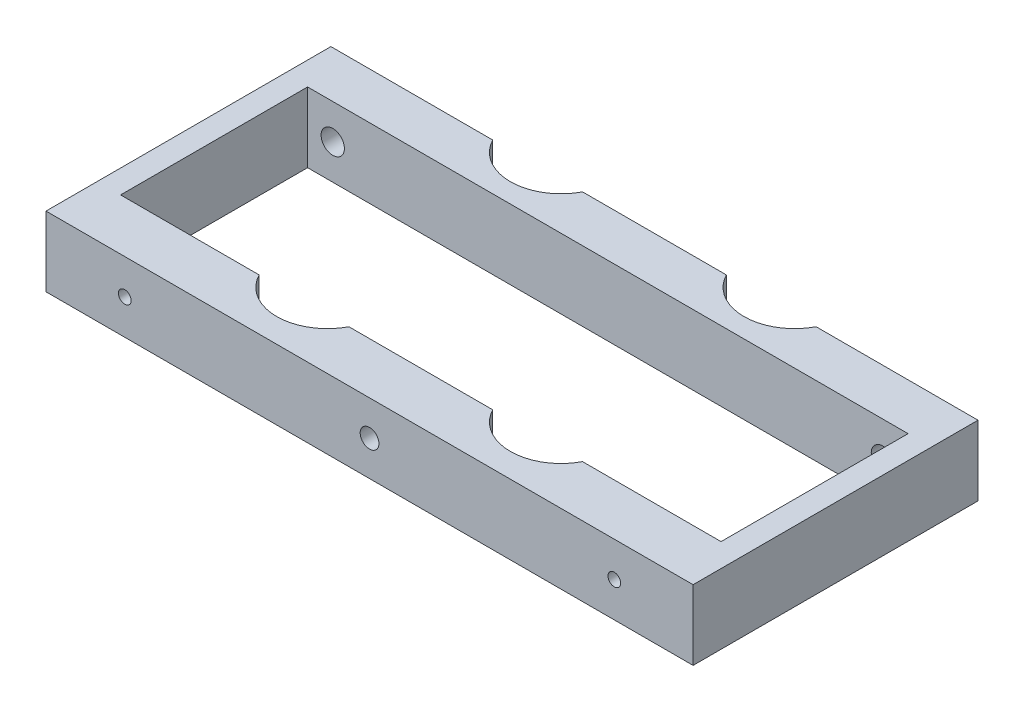
ISO-10303-21;
HEADER;
FILE_DESCRIPTION(('STEP AP214'),'2;1');
FILE_NAME('part.step','',(''),(''),'','','');
FILE_SCHEMA(('AUTOMOTIVE_DESIGN { 1 0 10303 214 1 1 1 1 }'));
ENDSEC;
DATA;
#1=APPLICATION_CONTEXT('core data for automotive mechanical design processes');
#2=APPLICATION_PROTOCOL_DEFINITION('international standard','automotive_design',2000,#1);
#3=PRODUCT_CONTEXT('',#1,'mechanical');
#4=PRODUCT('Part','Part','',(#3));
#5=PRODUCT_RELATED_PRODUCT_CATEGORY('part','',(#4));
#6=PRODUCT_DEFINITION_FORMATION('','',#4);
#7=PRODUCT_DEFINITION_CONTEXT('part definition',#1,'design');
#8=PRODUCT_DEFINITION('design','',#6,#7);
#9=PRODUCT_DEFINITION_SHAPE('','',#8);
#10=(LENGTH_UNIT() NAMED_UNIT(*) SI_UNIT(.MILLI.,.METRE.));
#11=(NAMED_UNIT(*) PLANE_ANGLE_UNIT() SI_UNIT($,.RADIAN.));
#12=(NAMED_UNIT(*) SI_UNIT($,.STERADIAN.) SOLID_ANGLE_UNIT());
#13=UNCERTAINTY_MEASURE_WITH_UNIT(LENGTH_MEASURE(1.E-05),#10,'distance_accuracy_value','');
#14=(GEOMETRIC_REPRESENTATION_CONTEXT(3) GLOBAL_UNCERTAINTY_ASSIGNED_CONTEXT((#13)) GLOBAL_UNIT_ASSIGNED_CONTEXT((#10,
#11,#12)) REPRESENTATION_CONTEXT('',''));
#15=CARTESIAN_POINT('',(0.,0.,0.));
#16=DIRECTION('',(0.,0.,1.));
#17=DIRECTION('',(1.,0.,0.));
#18=AXIS2_PLACEMENT_3D('',#15,#16,#17);
#19=CARTESIAN_POINT('',(119.95785,19.05,-83.9597));
#20=DIRECTION('',(0.,-1.,0.));
#21=DIRECTION('',(0.,0.,-1.));
#22=AXIS2_PLACEMENT_3D('',#19,#20,#21);
#23=CYLINDRICAL_SURFACE('',#22,13.7795);
#24=CARTESIAN_POINT('',(119.95785,0.,-83.9597));
#25=DIRECTION('',(0.,1.,0.));
#26=DIRECTION('',(0.,0.,1.));
#27=AXIS2_PLACEMENT_3D('',#24,#25,#26);
#28=CIRCLE('',#27,13.7795);
#29=CARTESIAN_POINT('',(107.728699569574,0.,-77.6097));
#30=VERTEX_POINT('',#29);
#31=CARTESIAN_POINT('',(132.187000430426,0.,-77.6097));
#32=VERTEX_POINT('',#31);
#33=EDGE_CURVE('E231',#30,#32,#28,.T.);
#34=ORIENTED_EDGE('',*,*,#33,.F.);
#35=DIRECTION('',(0.,-1.,0.));
#36=VECTOR('',#35,1.);
#37=CARTESIAN_POINT('',(107.728699569574,19.05,-77.6097));
#38=LINE('',#37,#36);
#39=CARTESIAN_POINT('',(107.728699569574,19.05,-77.6097));
#40=VERTEX_POINT('',#39);
#41=EDGE_CURVE('E11',#40,#30,#38,.T.);
#42=ORIENTED_EDGE('',*,*,#41,.F.);
#43=CARTESIAN_POINT('',(119.95785,19.05,-83.9597));
#44=DIRECTION('',(0.,1.,0.));
#45=DIRECTION('',(0.,0.,1.));
#46=AXIS2_PLACEMENT_3D('',#43,#44,#45);
#47=CIRCLE('',#46,13.7795);
#48=CARTESIAN_POINT('',(132.187000430426,19.05,-77.6097));
#49=VERTEX_POINT('',#48);
#50=EDGE_CURVE('E269',#40,#49,#47,.T.);
#51=ORIENTED_EDGE('',*,*,#50,.T.);
#52=DIRECTION('',(0.,-1.,0.));
#53=VECTOR('',#52,1.);
#54=CARTESIAN_POINT('',(132.187000430426,19.05,-77.6097));
#55=LINE('',#54,#53);
#56=EDGE_CURVE('E58',#49,#32,#55,.T.);
#57=ORIENTED_EDGE('',*,*,#56,.T.);
#58=EDGE_LOOP('',(#34,#42,#51,#57));
#59=FACE_BOUND('',#58,.T.);
#60=ADVANCED_FACE('F39',(#59),#23,.F.);
#61=CARTESIAN_POINT('',(0.,19.05,-77.6097));
#62=DIRECTION('',(0.,0.,-1.));
#63=DIRECTION('',(-1.,0.,0.));
#64=AXIS2_PLACEMENT_3D('',#61,#62,#63);
#65=PLANE('',#64);
#66=DIRECTION('',(1.,0.,0.));
#67=VECTOR('',#66,1.);
#68=CARTESIAN_POINT('',(0.,0.,-77.6097));
#69=LINE('',#68,#67);
#70=CARTESIAN_POINT('',(68.5473004304265,0.,-77.6097));
#71=VERTEX_POINT('',#70);
#72=EDGE_CURVE('E228',#71,#30,#69,.T.);
#73=ORIENTED_EDGE('',*,*,#72,.F.);
#74=DIRECTION('',(0.,-1.,0.));
#75=VECTOR('',#74,1.);
#76=CARTESIAN_POINT('',(68.5473004304265,19.05,-77.6097));
#77=LINE('',#76,#75);
#78=CARTESIAN_POINT('',(68.5473004304265,19.05,-77.6097));
#79=VERTEX_POINT('',#78);
#80=EDGE_CURVE('E49',#79,#71,#77,.T.);
#81=ORIENTED_EDGE('',*,*,#80,.F.);
#82=DIRECTION('',(1.,0.,0.));
#83=VECTOR('',#82,1.);
#84=CARTESIAN_POINT('',(0.,19.05,-77.6097));
#85=LINE('',#84,#83);
#86=EDGE_CURVE('E266',#79,#40,#85,.T.);
#87=ORIENTED_EDGE('',*,*,#86,.T.);
#88=ORIENTED_EDGE('',*,*,#41,.T.);
#89=EDGE_LOOP('',(#73,#81,#87,#88));
#90=FACE_BOUND('',#89,.T.);
#91=ADVANCED_FACE('F344',(#90),#65,.T.);
#92=CARTESIAN_POINT('',(56.31815,19.05,-83.9597));
#93=DIRECTION('',(0.,-1.,0.));
#94=DIRECTION('',(0.,0.,-1.));
#95=AXIS2_PLACEMENT_3D('',#92,#93,#94);
#96=CYLINDRICAL_SURFACE('',#95,13.7795);
#97=CARTESIAN_POINT('',(56.31815,0.,-83.9597));
#98=DIRECTION('',(0.,1.,0.));
#99=DIRECTION('',(0.,0.,1.));
#100=AXIS2_PLACEMENT_3D('',#97,#98,#99);
#101=CIRCLE('',#100,13.7795);
#102=CARTESIAN_POINT('',(44.0889995695735,0.,-77.6097));
#103=VERTEX_POINT('',#102);
#104=EDGE_CURVE('E225',#103,#71,#101,.T.);
#105=ORIENTED_EDGE('',*,*,#104,.F.);
#106=DIRECTION('',(0.,-1.,0.));
#107=VECTOR('',#106,1.);
#108=CARTESIAN_POINT('',(44.0889995695735,19.05,-77.6097));
#109=LINE('',#108,#107);
#110=CARTESIAN_POINT('',(44.0889995695735,19.05,-77.6097));
#111=VERTEX_POINT('',#110);
#112=EDGE_CURVE('E190',#111,#103,#109,.T.);
#113=ORIENTED_EDGE('',*,*,#112,.F.);
#114=CARTESIAN_POINT('',(56.31815,19.05,-83.9597));
#115=DIRECTION('',(0.,1.,0.));
#116=DIRECTION('',(0.,0.,1.));
#117=AXIS2_PLACEMENT_3D('',#114,#115,#116);
#118=CIRCLE('',#117,13.7795);
#119=EDGE_CURVE('E263',#111,#79,#118,.T.);
#120=ORIENTED_EDGE('',*,*,#119,.T.);
#121=ORIENTED_EDGE('',*,*,#80,.T.);
#122=EDGE_LOOP('',(#105,#113,#120,#121));
#123=FACE_BOUND('',#122,.T.);
#124=ADVANCED_FACE('F328',(#123),#96,.F.);
#125=CARTESIAN_POINT('',(0.,19.05,-77.6097));
#126=DIRECTION('',(0.,0.,-1.));
#127=DIRECTION('',(-1.,0.,0.));
#128=AXIS2_PLACEMENT_3D('',#125,#126,#127);
#129=PLANE('',#128);
#130=CARTESIAN_POINT('',(13.208,9.52500000000001,-77.6097));
#131=DIRECTION('',(0.,0.,-1.));
#132=DIRECTION('',(-1.,0.,0.));
#133=AXIS2_PLACEMENT_3D('',#130,#131,#132);
#134=CIRCLE('',#133,3.17499999999999);
#135=CARTESIAN_POINT('',(10.0330000000001,9.52500000000001,-77.6097));
#136=VERTEX_POINT('',#135);
#137=EDGE_CURVE('E317',#136,#136,#134,.T.);
#138=ORIENTED_EDGE('',*,*,#137,.F.);
#139=EDGE_LOOP('',(#138));
#140=FACE_BOUND('',#139,.T.);
#141=DIRECTION('',(1.,0.,0.));
#142=VECTOR('',#141,1.);
#143=CARTESIAN_POINT('',(0.,0.,-77.6097));
#144=LINE('',#143,#142);
#145=CARTESIAN_POINT('',(0.,0.,-77.6097));
#146=VERTEX_POINT('',#145);
#147=EDGE_CURVE('E222',#146,#103,#144,.T.);
#148=ORIENTED_EDGE('',*,*,#147,.F.);
#149=DIRECTION('',(0.,-1.,0.));
#150=VECTOR('',#149,1.);
#151=CARTESIAN_POINT('',(0.,19.05,-77.6097));
#152=LINE('',#151,#150);
#153=CARTESIAN_POINT('',(0.,19.05,-77.6097));
#154=VERTEX_POINT('',#153);
#155=EDGE_CURVE('E184',#154,#146,#152,.T.);
#156=ORIENTED_EDGE('',*,*,#155,.F.);
#157=DIRECTION('',(1.,0.,0.));
#158=VECTOR('',#157,1.);
#159=CARTESIAN_POINT('',(0.,19.05,-77.6097));
#160=LINE('',#159,#158);
#161=EDGE_CURVE('E260',#154,#111,#160,.T.);
#162=ORIENTED_EDGE('',*,*,#161,.T.);
#163=ORIENTED_EDGE('',*,*,#112,.T.);
#164=EDGE_LOOP('',(#148,#156,#162,#163));
#165=FACE_BOUND('',#164,.T.);
#166=ADVANCED_FACE('F324',(#140,#165),#129,.T.);
#167=CARTESIAN_POINT('',(0.,19.05,0.));
#168=DIRECTION('',(-1.,0.,0.));
#169=DIRECTION('',(0.,0.,1.));
#170=AXIS2_PLACEMENT_3D('',#167,#168,#169);
#171=PLANE('',#170);
#172=DIRECTION('',(0.,0.,-1.));
#173=VECTOR('',#172,1.);
#174=CARTESIAN_POINT('',(0.,0.,0.));
#175=LINE('',#174,#173);
#176=CARTESIAN_POINT('',(0.,0.,0.));
#177=VERTEX_POINT('',#176);
#178=EDGE_CURVE('E219',#177,#146,#175,.T.);
#179=ORIENTED_EDGE('',*,*,#178,.F.);
#180=DIRECTION('',(0.,-1.,0.));
#181=VECTOR('',#180,1.);
#182=CARTESIAN_POINT('',(0.,19.05,0.));
#183=LINE('',#182,#181);
#184=CARTESIAN_POINT('',(0.,19.05,0.));
#185=VERTEX_POINT('',#184);
#186=EDGE_CURVE('E182',#185,#177,#183,.T.);
#187=ORIENTED_EDGE('',*,*,#186,.F.);
#188=DIRECTION('',(0.,0.,-1.));
#189=VECTOR('',#188,1.);
#190=CARTESIAN_POINT('',(0.,19.05,0.));
#191=LINE('',#190,#189);
#192=EDGE_CURVE('E176',#185,#154,#191,.T.);
#193=ORIENTED_EDGE('',*,*,#192,.T.);
#194=ORIENTED_EDGE('',*,*,#155,.T.);
#195=EDGE_LOOP('',(#179,#187,#193,#194));
#196=FACE_BOUND('',#195,.T.);
#197=ADVANCED_FACE('F327',(#196),#171,.T.);
#198=CARTESIAN_POINT('',(0.,19.05,0.));
#199=DIRECTION('',(0.,0.,-1.));
#200=DIRECTION('',(-1.,0.,0.));
#201=AXIS2_PLACEMENT_3D('',#198,#199,#200);
#202=PLANE('',#201);
#203=CARTESIAN_POINT('',(88.138,9.525,0.));
#204=DIRECTION('',(0.,0.,1.));
#205=DIRECTION('',(1.,0.,0.));
#206=AXIS2_PLACEMENT_3D('',#203,#204,#205);
#207=CIRCLE('',#206,2.55269999999999);
#208=CARTESIAN_POINT('',(90.6907,9.525,0.));
#209=VERTEX_POINT('',#208);
#210=EDGE_CURVE('E305',#209,#209,#207,.T.);
#211=ORIENTED_EDGE('',*,*,#210,.F.);
#212=EDGE_LOOP('',(#211));
#213=FACE_BOUND('',#212,.T.);
#214=CARTESIAN_POINT('',(154.813,9.52500000000001,0.));
#215=DIRECTION('',(0.,0.,1.));
#216=DIRECTION('',(1.,0.,0.));
#217=AXIS2_PLACEMENT_3D('',#214,#215,#216);
#218=CIRCLE('',#217,1.72719999999998);
#219=CARTESIAN_POINT('',(156.5402,9.52500000000001,0.));
#220=VERTEX_POINT('',#219);
#221=EDGE_CURVE('E299',#220,#220,#218,.T.);
#222=ORIENTED_EDGE('',*,*,#221,.F.);
#223=EDGE_LOOP('',(#222));
#224=FACE_BOUND('',#223,.T.);
#225=CARTESIAN_POINT('',(21.463,9.525,0.));
#226=DIRECTION('',(0.,0.,1.));
#227=DIRECTION('',(1.,0.,0.));
#228=AXIS2_PLACEMENT_3D('',#225,#226,#227);
#229=CIRCLE('',#228,1.7272);
#230=CARTESIAN_POINT('',(23.1902,9.525,0.));
#231=VERTEX_POINT('',#230);
#232=EDGE_CURVE('E293',#231,#231,#229,.T.);
#233=ORIENTED_EDGE('',*,*,#232,.F.);
#234=EDGE_LOOP('',(#233));
#235=FACE_BOUND('',#234,.T.);
#236=DIRECTION('',(1.,0.,0.));
#237=VECTOR('',#236,1.);
#238=CARTESIAN_POINT('',(0.,0.,0.));
#239=LINE('',#238,#237);
#240=CARTESIAN_POINT('',(176.276,0.,0.));
#241=VERTEX_POINT('',#240);
#242=EDGE_CURVE('E181',#177,#241,#239,.T.);
#243=ORIENTED_EDGE('',*,*,#242,.T.);
#244=DIRECTION('',(0.,-1.,0.));
#245=VECTOR('',#244,1.);
#246=CARTESIAN_POINT('',(176.276,19.05,0.));
#247=LINE('',#246,#245);
#248=CARTESIAN_POINT('',(176.276,19.05,0.));
#249=VERTEX_POINT('',#248);
#250=EDGE_CURVE('E163',#249,#241,#247,.T.);
#251=ORIENTED_EDGE('',*,*,#250,.F.);
#252=DIRECTION('',(1.,0.,0.));
#253=VECTOR('',#252,1.);
#254=CARTESIAN_POINT('',(0.,19.05,0.));
#255=LINE('',#254,#253);
#256=EDGE_CURVE('E168',#185,#249,#255,.T.);
#257=ORIENTED_EDGE('',*,*,#256,.F.);
#258=ORIENTED_EDGE('',*,*,#186,.T.);
#259=EDGE_LOOP('',(#243,#251,#257,#258));
#260=FACE_BOUND('',#259,.T.);
#261=ADVANCED_FACE('F179',(#213,#224,#235,#260),#202,.F.);
#262=CARTESIAN_POINT('',(176.276,19.05,0.));
#263=DIRECTION('',(-1.,0.,0.));
#264=DIRECTION('',(0.,0.,1.));
#265=AXIS2_PLACEMENT_3D('',#262,#263,#264);
#266=PLANE('',#265);
#267=DIRECTION('',(0.,0.,-1.));
#268=VECTOR('',#267,1.);
#269=CARTESIAN_POINT('',(176.276,0.,0.));
#270=LINE('',#269,#268);
#271=CARTESIAN_POINT('',(176.276,0.,-77.6097));
#272=VERTEX_POINT('',#271);
#273=EDGE_CURVE('E216',#241,#272,#270,.T.);
#274=ORIENTED_EDGE('',*,*,#273,.T.);
#275=DIRECTION('',(0.,-1.,0.));
#276=VECTOR('',#275,1.);
#277=CARTESIAN_POINT('',(176.276,19.05,-77.6097));
#278=LINE('',#277,#276);
#279=CARTESIAN_POINT('',(176.276,19.05,-77.6097));
#280=VERTEX_POINT('',#279);
#281=EDGE_CURVE('E108',#280,#272,#278,.T.);
#282=ORIENTED_EDGE('',*,*,#281,.F.);
#283=DIRECTION('',(0.,0.,-1.));
#284=VECTOR('',#283,1.);
#285=CARTESIAN_POINT('',(176.276,19.05,0.));
#286=LINE('',#285,#284);
#287=EDGE_CURVE('E159',#249,#280,#286,.T.);
#288=ORIENTED_EDGE('',*,*,#287,.F.);
#289=ORIENTED_EDGE('',*,*,#250,.T.);
#290=EDGE_LOOP('',(#274,#282,#288,#289));
#291=FACE_BOUND('',#290,.T.);
#292=ADVANCED_FACE('F161',(#291),#266,.F.);
#293=CARTESIAN_POINT('',(119.95785,19.05,-20.32));
#294=DIRECTION('',(0.,-1.,0.));
#295=DIRECTION('',(0.,0.,-1.));
#296=AXIS2_PLACEMENT_3D('',#293,#294,#295);
#297=CYLINDRICAL_SURFACE('',#296,13.7795);
#298=CARTESIAN_POINT('',(119.95785,0.,-20.32));
#299=DIRECTION('',(0.,1.,0.));
#300=DIRECTION('',(0.,0.,1.));
#301=AXIS2_PLACEMENT_3D('',#298,#299,#300);
#302=CIRCLE('',#301,13.7795);
#303=CARTESIAN_POINT('',(107.728699569574,0.,-13.97));
#304=VERTEX_POINT('',#303);
#305=CARTESIAN_POINT('',(132.187000430426,0.,-13.97));
#306=VERTEX_POINT('',#305);
#307=EDGE_CURVE('E254',#304,#306,#302,.T.);
#308=ORIENTED_EDGE('',*,*,#307,.F.);
#309=DIRECTION('',(0.,-1.,0.));
#310=VECTOR('',#309,1.);
#311=CARTESIAN_POINT('',(107.728699569574,19.05,-13.97));
#312=LINE('',#311,#310);
#313=CARTESIAN_POINT('',(107.728699569574,19.05,-13.97));
#314=VERTEX_POINT('',#313);
#315=EDGE_CURVE('E43',#314,#304,#312,.T.);
#316=ORIENTED_EDGE('',*,*,#315,.F.);
#317=CARTESIAN_POINT('',(119.95785,19.05,-20.32));
#318=DIRECTION('',(0.,1.,0.));
#319=DIRECTION('',(0.,0.,1.));
#320=AXIS2_PLACEMENT_3D('',#317,#318,#319);
#321=CIRCLE('',#320,13.7795);
#322=CARTESIAN_POINT('',(132.187000430426,19.05,-13.97));
#323=VERTEX_POINT('',#322);
#324=EDGE_CURVE('E215',#314,#323,#321,.T.);
#325=ORIENTED_EDGE('',*,*,#324,.T.);
#326=DIRECTION('',(0.,-1.,0.));
#327=VECTOR('',#326,1.);
#328=CARTESIAN_POINT('',(132.187000430426,19.05,-13.97));
#329=LINE('',#328,#327);
#330=EDGE_CURVE('E193',#323,#306,#329,.T.);
#331=ORIENTED_EDGE('',*,*,#330,.T.);
#332=EDGE_LOOP('',(#308,#316,#325,#331));
#333=FACE_BOUND('',#332,.T.);
#334=ADVANCED_FACE('F41',(#333),#297,.F.);
#335=CARTESIAN_POINT('',(0.,19.05,-13.97));
#336=DIRECTION('',(0.,0.,-1.));
#337=DIRECTION('',(-1.,0.,0.));
#338=AXIS2_PLACEMENT_3D('',#335,#336,#337);
#339=PLANE('',#338);
#340=CARTESIAN_POINT('',(88.138,9.525,-13.97));
#341=DIRECTION('',(0.,0.,-1.));
#342=DIRECTION('',(-1.,0.,0.));
#343=AXIS2_PLACEMENT_3D('',#340,#341,#342);
#344=CIRCLE('',#343,2.55269999999999);
#345=CARTESIAN_POINT('',(85.5853,9.525,-13.97));
#346=VERTEX_POINT('',#345);
#347=EDGE_CURVE('E302',#346,#346,#344,.T.);
#348=ORIENTED_EDGE('',*,*,#347,.F.);
#349=EDGE_LOOP('',(#348));
#350=FACE_BOUND('',#349,.T.);
#351=DIRECTION('',(1.,0.,0.));
#352=VECTOR('',#351,1.);
#353=CARTESIAN_POINT('',(0.,0.,-13.97));
#354=LINE('',#353,#352);
#355=CARTESIAN_POINT('',(68.5473004304265,0.,-13.97));
#356=VERTEX_POINT('',#355);
#357=EDGE_CURVE('E251',#356,#304,#354,.T.);
#358=ORIENTED_EDGE('',*,*,#357,.F.);
#359=DIRECTION('',(0.,-1.,0.));
#360=VECTOR('',#359,1.);
#361=CARTESIAN_POINT('',(68.5473004304265,19.05,-13.97));
#362=LINE('',#361,#360);
#363=CARTESIAN_POINT('',(68.5473004304265,19.05,-13.97));
#364=VERTEX_POINT('',#363);
#365=EDGE_CURVE('E204',#364,#356,#362,.T.);
#366=ORIENTED_EDGE('',*,*,#365,.F.);
#367=DIRECTION('',(1.,0.,0.));
#368=VECTOR('',#367,1.);
#369=CARTESIAN_POINT('',(0.,19.05,-13.97));
#370=LINE('',#369,#368);
#371=EDGE_CURVE('E288',#364,#314,#370,.T.);
#372=ORIENTED_EDGE('',*,*,#371,.T.);
#373=ORIENTED_EDGE('',*,*,#315,.T.);
#374=EDGE_LOOP('',(#358,#366,#372,#373));
#375=FACE_BOUND('',#374,.T.);
#376=ADVANCED_FACE('F376',(#350,#375),#339,.T.);
#377=CARTESIAN_POINT('',(56.31815,19.05,-20.32));
#378=DIRECTION('',(0.,-1.,0.));
#379=DIRECTION('',(0.,0.,-1.));
#380=AXIS2_PLACEMENT_3D('',#377,#378,#379);
#381=CYLINDRICAL_SURFACE('',#380,13.7795);
#382=CARTESIAN_POINT('',(56.31815,0.,-20.32));
#383=DIRECTION('',(0.,1.,0.));
#384=DIRECTION('',(0.,0.,1.));
#385=AXIS2_PLACEMENT_3D('',#382,#383,#384);
#386=CIRCLE('',#385,13.7795);
#387=CARTESIAN_POINT('',(44.0889995695735,0.,-13.97));
#388=VERTEX_POINT('',#387);
#389=EDGE_CURVE('E248',#388,#356,#386,.T.);
#390=ORIENTED_EDGE('',*,*,#389,.F.);
#391=DIRECTION('',(0.,-1.,0.));
#392=VECTOR('',#391,1.);
#393=CARTESIAN_POINT('',(44.0889995695735,19.05,-13.97));
#394=LINE('',#393,#392);
#395=CARTESIAN_POINT('',(44.0889995695735,19.05,-13.97));
#396=VERTEX_POINT('',#395);
#397=EDGE_CURVE('E203',#396,#388,#394,.T.);
#398=ORIENTED_EDGE('',*,*,#397,.F.);
#399=CARTESIAN_POINT('',(56.31815,19.05,-20.32));
#400=DIRECTION('',(0.,1.,0.));
#401=DIRECTION('',(0.,0.,1.));
#402=AXIS2_PLACEMENT_3D('',#399,#400,#401);
#403=CIRCLE('',#402,13.7795);
#404=EDGE_CURVE('E286',#396,#364,#403,.T.);
#405=ORIENTED_EDGE('',*,*,#404,.T.);
#406=ORIENTED_EDGE('',*,*,#365,.T.);
#407=EDGE_LOOP('',(#390,#398,#405,#406));
#408=FACE_BOUND('',#407,.T.);
#409=ADVANCED_FACE('F373',(#408),#381,.F.);
#410=CARTESIAN_POINT('',(0.,19.05,-13.97));
#411=DIRECTION('',(0.,0.,-1.));
#412=DIRECTION('',(-1.,0.,0.));
#413=AXIS2_PLACEMENT_3D('',#410,#411,#412);
#414=PLANE('',#413);
#415=CARTESIAN_POINT('',(21.463,9.525,-13.97));
#416=DIRECTION('',(0.,0.,-1.));
#417=DIRECTION('',(-1.,0.,0.));
#418=AXIS2_PLACEMENT_3D('',#415,#416,#417);
#419=CIRCLE('',#418,1.7272);
#420=CARTESIAN_POINT('',(19.7358,9.525,-13.97));
#421=VERTEX_POINT('',#420);
#422=EDGE_CURVE('E257',#421,#421,#419,.T.);
#423=ORIENTED_EDGE('',*,*,#422,.F.);
#424=EDGE_LOOP('',(#423));
#425=FACE_BOUND('',#424,.T.);
#426=DIRECTION('',(1.,0.,0.));
#427=VECTOR('',#426,1.);
#428=CARTESIAN_POINT('',(0.,0.,-13.97));
#429=LINE('',#428,#427);
#430=CARTESIAN_POINT('',(6.35000000000001,0.,-13.97));
#431=VERTEX_POINT('',#430);
#432=EDGE_CURVE('E245',#431,#388,#429,.T.);
#433=ORIENTED_EDGE('',*,*,#432,.F.);
#434=DIRECTION('',(0.,-1.,0.));
#435=VECTOR('',#434,1.);
#436=CARTESIAN_POINT('',(6.35000000000001,19.05,-13.97));
#437=LINE('',#436,#435);
#438=CARTESIAN_POINT('',(6.35000000000001,19.05,-13.97));
#439=VERTEX_POINT('',#438);
#440=EDGE_CURVE('E201',#439,#431,#437,.T.);
#441=ORIENTED_EDGE('',*,*,#440,.F.);
#442=DIRECTION('',(1.,0.,0.));
#443=VECTOR('',#442,1.);
#444=CARTESIAN_POINT('',(0.,19.05,-13.97));
#445=LINE('',#444,#443);
#446=EDGE_CURVE('E283',#439,#396,#445,.T.);
#447=ORIENTED_EDGE('',*,*,#446,.T.);
#448=ORIENTED_EDGE('',*,*,#397,.T.);
#449=EDGE_LOOP('',(#433,#441,#447,#448));
#450=FACE_BOUND('',#449,.T.);
#451=ADVANCED_FACE('F369',(#425,#450),#414,.T.);
#452=CARTESIAN_POINT('',(6.35000000000001,19.05,0.));
#453=DIRECTION('',(1.,0.,0.));
#454=DIRECTION('',(0.,0.,-1.));
#455=AXIS2_PLACEMENT_3D('',#452,#453,#454);
#456=PLANE('',#455);
#457=DIRECTION('',(0.,0.,1.));
#458=VECTOR('',#457,1.);
#459=CARTESIAN_POINT('',(6.35000000000001,0.,0.));
#460=LINE('',#459,#458);
#461=CARTESIAN_POINT('',(6.34999999999999,0.,-64.9097));
#462=VERTEX_POINT('',#461);
#463=EDGE_CURVE('E242',#462,#431,#460,.T.);
#464=ORIENTED_EDGE('',*,*,#463,.F.);
#465=DIRECTION('',(0.,-1.,0.));
#466=VECTOR('',#465,1.);
#467=CARTESIAN_POINT('',(6.34999999999999,19.05,-64.9097));
#468=LINE('',#467,#466);
#469=CARTESIAN_POINT('',(6.34999999999999,19.05,-64.9097));
#470=VERTEX_POINT('',#469);
#471=EDGE_CURVE('E199',#470,#462,#468,.T.);
#472=ORIENTED_EDGE('',*,*,#471,.F.);
#473=DIRECTION('',(0.,0.,1.));
#474=VECTOR('',#473,1.);
#475=CARTESIAN_POINT('',(6.35000000000001,19.05,0.));
#476=LINE('',#475,#474);
#477=EDGE_CURVE('E280',#470,#439,#476,.T.);
#478=ORIENTED_EDGE('',*,*,#477,.T.);
#479=ORIENTED_EDGE('',*,*,#440,.T.);
#480=EDGE_LOOP('',(#464,#472,#478,#479));
#481=FACE_BOUND('',#480,.T.);
#482=ADVANCED_FACE('F365',(#481),#456,.T.);
#483=CARTESIAN_POINT('',(0.,19.05,-64.9097));
#484=DIRECTION('',(0.,0.,1.));
#485=DIRECTION('',(1.,0.,0.));
#486=AXIS2_PLACEMENT_3D('',#483,#484,#485);
#487=PLANE('',#486);
#488=CARTESIAN_POINT('',(13.208,9.52500000000001,-64.9097));
#489=DIRECTION('',(0.,0.,1.));
#490=DIRECTION('',(1.,0.,0.));
#491=AXIS2_PLACEMENT_3D('',#488,#489,#490);
#492=CIRCLE('',#491,3.17499999999999);
#493=CARTESIAN_POINT('',(16.383,9.52500000000001,-64.9097));
#494=VERTEX_POINT('',#493);
#495=EDGE_CURVE('E314',#494,#494,#492,.T.);
#496=ORIENTED_EDGE('',*,*,#495,.F.);
#497=EDGE_LOOP('',(#496));
#498=FACE_BOUND('',#497,.T.);
#499=CARTESIAN_POINT('',(163.068,9.525,-64.9097));
#500=DIRECTION('',(0.,0.,1.));
#501=DIRECTION('',(1.,0.,0.));
#502=AXIS2_PLACEMENT_3D('',#499,#500,#501);
#503=CIRCLE('',#502,3.17499999999998);
#504=CARTESIAN_POINT('',(166.243,9.525,-64.9097));
#505=VERTEX_POINT('',#504);
#506=EDGE_CURVE('E308',#505,#505,#503,.T.);
#507=ORIENTED_EDGE('',*,*,#506,.F.);
#508=EDGE_LOOP('',(#507));
#509=FACE_BOUND('',#508,.T.);
#510=DIRECTION('',(-1.,0.,0.));
#511=VECTOR('',#510,1.);
#512=CARTESIAN_POINT('',(0.,0.,-64.9097));
#513=LINE('',#512,#511);
#514=CARTESIAN_POINT('',(169.926,0.,-64.9097));
#515=VERTEX_POINT('',#514);
#516=EDGE_CURVE('E239',#515,#462,#513,.T.);
#517=ORIENTED_EDGE('',*,*,#516,.F.);
#518=DIRECTION('',(0.,-1.,0.));
#519=VECTOR('',#518,1.);
#520=CARTESIAN_POINT('',(169.926,19.05,-64.9097));
#521=LINE('',#520,#519);
#522=CARTESIAN_POINT('',(169.926,19.05,-64.9097));
#523=VERTEX_POINT('',#522);
#524=EDGE_CURVE('E197',#523,#515,#521,.T.);
#525=ORIENTED_EDGE('',*,*,#524,.F.);
#526=DIRECTION('',(-1.,0.,0.));
#527=VECTOR('',#526,1.);
#528=CARTESIAN_POINT('',(0.,19.05,-64.9097));
#529=LINE('',#528,#527);
#530=EDGE_CURVE('E277',#523,#470,#529,.T.);
#531=ORIENTED_EDGE('',*,*,#530,.T.);
#532=ORIENTED_EDGE('',*,*,#471,.T.);
#533=EDGE_LOOP('',(#517,#525,#531,#532));
#534=FACE_BOUND('',#533,.T.);
#535=ADVANCED_FACE('F361',(#498,#509,#534),#487,.T.);
#536=CARTESIAN_POINT('',(169.926,19.05,0.));
#537=DIRECTION('',(-1.,0.,0.));
#538=DIRECTION('',(0.,0.,1.));
#539=AXIS2_PLACEMENT_3D('',#536,#537,#538);
#540=PLANE('',#539);
#541=DIRECTION('',(0.,0.,-1.));
#542=VECTOR('',#541,1.);
#543=CARTESIAN_POINT('',(169.926,0.,0.));
#544=LINE('',#543,#542);
#545=CARTESIAN_POINT('',(169.926,0.,-13.97));
#546=VERTEX_POINT('',#545);
#547=EDGE_CURVE('E236',#546,#515,#544,.T.);
#548=ORIENTED_EDGE('',*,*,#547,.F.);
#549=DIRECTION('',(0.,-1.,0.));
#550=VECTOR('',#549,1.);
#551=CARTESIAN_POINT('',(169.926,19.05,-13.97));
#552=LINE('',#551,#550);
#553=CARTESIAN_POINT('',(169.926,19.05,-13.97));
#554=VERTEX_POINT('',#553);
#555=EDGE_CURVE('E195',#554,#546,#552,.T.);
#556=ORIENTED_EDGE('',*,*,#555,.F.);
#557=DIRECTION('',(0.,0.,-1.));
#558=VECTOR('',#557,1.);
#559=CARTESIAN_POINT('',(169.926,19.05,0.));
#560=LINE('',#559,#558);
#561=EDGE_CURVE('E274',#554,#523,#560,.T.);
#562=ORIENTED_EDGE('',*,*,#561,.T.);
#563=ORIENTED_EDGE('',*,*,#524,.T.);
#564=EDGE_LOOP('',(#548,#556,#562,#563));
#565=FACE_BOUND('',#564,.T.);
#566=ADVANCED_FACE('F357',(#565),#540,.T.);
#567=CARTESIAN_POINT('',(0.,19.05,-13.97));
#568=DIRECTION('',(0.,0.,-1.));
#569=DIRECTION('',(-1.,0.,0.));
#570=AXIS2_PLACEMENT_3D('',#567,#568,#569);
#571=PLANE('',#570);
#572=CARTESIAN_POINT('',(154.813,9.52500000000001,-13.97));
#573=DIRECTION('',(0.,0.,-1.));
#574=DIRECTION('',(-1.,0.,0.));
#575=AXIS2_PLACEMENT_3D('',#572,#573,#574);
#576=CIRCLE('',#575,1.72719999999998);
#577=CARTESIAN_POINT('',(153.0858,9.52500000000001,-13.97));
#578=VERTEX_POINT('',#577);
#579=EDGE_CURVE('E296',#578,#578,#576,.T.);
#580=ORIENTED_EDGE('',*,*,#579,.F.);
#581=EDGE_LOOP('',(#580));
#582=FACE_BOUND('',#581,.T.);
#583=DIRECTION('',(1.,0.,0.));
#584=VECTOR('',#583,1.);
#585=CARTESIAN_POINT('',(0.,0.,-13.97));
#586=LINE('',#585,#584);
#587=EDGE_CURVE('E233',#306,#546,#586,.T.);
#588=ORIENTED_EDGE('',*,*,#587,.F.);
#589=ORIENTED_EDGE('',*,*,#330,.F.);
#590=DIRECTION('',(1.,0.,0.));
#591=VECTOR('',#590,1.);
#592=CARTESIAN_POINT('',(0.,19.05,-13.97));
#593=LINE('',#592,#591);
#594=EDGE_CURVE('E271',#323,#554,#593,.T.);
#595=ORIENTED_EDGE('',*,*,#594,.T.);
#596=ORIENTED_EDGE('',*,*,#555,.T.);
#597=EDGE_LOOP('',(#588,#589,#595,#596));
#598=FACE_BOUND('',#597,.T.);
#599=ADVANCED_FACE('F353',(#582,#598),#571,.T.);
#600=CARTESIAN_POINT('',(0.,19.05,-77.6097));
#601=DIRECTION('',(0.,0.,-1.));
#602=DIRECTION('',(-1.,0.,0.));
#603=AXIS2_PLACEMENT_3D('',#600,#601,#602);
#604=PLANE('',#603);
#605=CARTESIAN_POINT('',(163.068,9.525,-77.6097));
#606=DIRECTION('',(0.,0.,-1.));
#607=DIRECTION('',(-1.,0.,0.));
#608=AXIS2_PLACEMENT_3D('',#605,#606,#607);
#609=CIRCLE('',#608,3.17499999999998);
#610=CARTESIAN_POINT('',(159.893,9.525,-77.6097));
#611=VERTEX_POINT('',#610);
#612=EDGE_CURVE('E311',#611,#611,#609,.T.);
#613=ORIENTED_EDGE('',*,*,#612,.F.);
#614=EDGE_LOOP('',(#613));
#615=FACE_BOUND('',#614,.T.);
#616=DIRECTION('',(1.,0.,0.));
#617=VECTOR('',#616,1.);
#618=CARTESIAN_POINT('',(0.,0.,-77.6097));
#619=LINE('',#618,#617);
#620=EDGE_CURVE('E212',#32,#272,#619,.T.);
#621=ORIENTED_EDGE('',*,*,#620,.F.);
#622=ORIENTED_EDGE('',*,*,#56,.F.);
#623=DIRECTION('',(1.,0.,0.));
#624=VECTOR('',#623,1.);
#625=CARTESIAN_POINT('',(0.,19.05,-77.6097));
#626=LINE('',#625,#624);
#627=EDGE_CURVE('E167',#49,#280,#626,.T.);
#628=ORIENTED_EDGE('',*,*,#627,.T.);
#629=ORIENTED_EDGE('',*,*,#281,.T.);
#630=EDGE_LOOP('',(#621,#622,#628,#629));
#631=FACE_BOUND('',#630,.T.);
#632=ADVANCED_FACE('F356',(#615,#631),#604,.T.);
#633=CARTESIAN_POINT('',(0.,19.05,0.));
#634=DIRECTION('',(0.,1.,0.));
#635=DIRECTION('',(0.,0.,1.));
#636=AXIS2_PLACEMENT_3D('',#633,#634,#635);
#637=PLANE('',#636);
#638=ORIENTED_EDGE('',*,*,#324,.F.);
#639=ORIENTED_EDGE('',*,*,#371,.F.);
#640=ORIENTED_EDGE('',*,*,#404,.F.);
#641=ORIENTED_EDGE('',*,*,#446,.F.);
#642=ORIENTED_EDGE('',*,*,#477,.F.);
#643=ORIENTED_EDGE('',*,*,#530,.F.);
#644=ORIENTED_EDGE('',*,*,#561,.F.);
#645=ORIENTED_EDGE('',*,*,#594,.F.);
#646=EDGE_LOOP('',(#638,#639,#640,#641,#642,#643,#644,#645));
#647=FACE_BOUND('',#646,.T.);
#648=ORIENTED_EDGE('',*,*,#50,.F.);
#649=ORIENTED_EDGE('',*,*,#86,.F.);
#650=ORIENTED_EDGE('',*,*,#119,.F.);
#651=ORIENTED_EDGE('',*,*,#161,.F.);
#652=ORIENTED_EDGE('',*,*,#192,.F.);
#653=ORIENTED_EDGE('',*,*,#256,.T.);
#654=ORIENTED_EDGE('',*,*,#287,.T.);
#655=ORIENTED_EDGE('',*,*,#627,.F.);
#656=EDGE_LOOP('',(#648,#649,#650,#651,#652,#653,#654,#655));
#657=FACE_BOUND('',#656,.T.);
#658=ADVANCED_FACE('F173',(#647,#657),#637,.T.);
#659=CARTESIAN_POINT('',(0.,0.,0.));
#660=DIRECTION('',(0.,1.,0.));
#661=DIRECTION('',(0.,0.,1.));
#662=AXIS2_PLACEMENT_3D('',#659,#660,#661);
#663=PLANE('',#662);
#664=ORIENTED_EDGE('',*,*,#307,.T.);
#665=ORIENTED_EDGE('',*,*,#587,.T.);
#666=ORIENTED_EDGE('',*,*,#547,.T.);
#667=ORIENTED_EDGE('',*,*,#516,.T.);
#668=ORIENTED_EDGE('',*,*,#463,.T.);
#669=ORIENTED_EDGE('',*,*,#432,.T.);
#670=ORIENTED_EDGE('',*,*,#389,.T.);
#671=ORIENTED_EDGE('',*,*,#357,.T.);
#672=EDGE_LOOP('',(#664,#665,#666,#667,#668,#669,#670,#671));
#673=FACE_BOUND('',#672,.T.);
#674=ORIENTED_EDGE('',*,*,#33,.T.);
#675=ORIENTED_EDGE('',*,*,#620,.T.);
#676=ORIENTED_EDGE('',*,*,#273,.F.);
#677=ORIENTED_EDGE('',*,*,#242,.F.);
#678=ORIENTED_EDGE('',*,*,#178,.T.);
#679=ORIENTED_EDGE('',*,*,#147,.T.);
#680=ORIENTED_EDGE('',*,*,#104,.T.);
#681=ORIENTED_EDGE('',*,*,#72,.T.);
#682=EDGE_LOOP('',(#674,#675,#676,#677,#678,#679,#680,#681));
#683=FACE_BOUND('',#682,.T.);
#684=ADVANCED_FACE('F334',(#673,#683),#663,.F.);
#685=CARTESIAN_POINT('',(21.463,9.525,0.));
#686=DIRECTION('',(0.,0.,1.));
#687=DIRECTION('',(1.,0.,0.));
#688=AXIS2_PLACEMENT_3D('',#685,#686,#687);
#689=CYLINDRICAL_SURFACE('',#688,1.7272);
#690=ORIENTED_EDGE('',*,*,#232,.T.);
#691=EDGE_LOOP('',(#690));
#692=FACE_BOUND('',#691,.T.);
#693=ORIENTED_EDGE('',*,*,#422,.T.);
#694=EDGE_LOOP('',(#693));
#695=FACE_BOUND('',#694,.T.);
#696=ADVANCED_FACE('F406',(#692,#695),#689,.F.);
#697=CARTESIAN_POINT('',(154.813,9.52500000000001,0.));
#698=DIRECTION('',(0.,0.,1.));
#699=DIRECTION('',(1.,0.,0.));
#700=AXIS2_PLACEMENT_3D('',#697,#698,#699);
#701=CYLINDRICAL_SURFACE('',#700,1.72719999999998);
#702=ORIENTED_EDGE('',*,*,#221,.T.);
#703=EDGE_LOOP('',(#702));
#704=FACE_BOUND('',#703,.T.);
#705=ORIENTED_EDGE('',*,*,#579,.T.);
#706=EDGE_LOOP('',(#705));
#707=FACE_BOUND('',#706,.T.);
#708=ADVANCED_FACE('F475',(#704,#707),#701,.F.);
#709=CARTESIAN_POINT('',(88.138,9.525,0.));
#710=DIRECTION('',(0.,0.,1.));
#711=DIRECTION('',(1.,0.,0.));
#712=AXIS2_PLACEMENT_3D('',#709,#710,#711);
#713=CYLINDRICAL_SURFACE('',#712,2.55269999999999);
#714=ORIENTED_EDGE('',*,*,#210,.T.);
#715=EDGE_LOOP('',(#714));
#716=FACE_BOUND('',#715,.T.);
#717=ORIENTED_EDGE('',*,*,#347,.T.);
#718=EDGE_LOOP('',(#717));
#719=FACE_BOUND('',#718,.T.);
#720=ADVANCED_FACE('F484',(#716,#719),#713,.F.);
#721=CARTESIAN_POINT('',(163.068,9.525,-77.6097));
#722=DIRECTION('',(0.,0.,-1.));
#723=DIRECTION('',(-1.,0.,0.));
#724=AXIS2_PLACEMENT_3D('',#721,#722,#723);
#725=CYLINDRICAL_SURFACE('',#724,3.17499999999998);
#726=ORIENTED_EDGE('',*,*,#612,.T.);
#727=EDGE_LOOP('',(#726));
#728=FACE_BOUND('',#727,.T.);
#729=ORIENTED_EDGE('',*,*,#506,.T.);
#730=EDGE_LOOP('',(#729));
#731=FACE_BOUND('',#730,.T.);
#732=ADVANCED_FACE('F502',(#728,#731),#725,.F.);
#733=CARTESIAN_POINT('',(13.208,9.52500000000001,-77.6097));
#734=DIRECTION('',(0.,0.,-1.));
#735=DIRECTION('',(-1.,0.,0.));
#736=AXIS2_PLACEMENT_3D('',#733,#734,#735);
#737=CYLINDRICAL_SURFACE('',#736,3.17499999999999);
#738=ORIENTED_EDGE('',*,*,#137,.T.);
#739=EDGE_LOOP('',(#738));
#740=FACE_BOUND('',#739,.T.);
#741=ORIENTED_EDGE('',*,*,#495,.T.);
#742=EDGE_LOOP('',(#741));
#743=FACE_BOUND('',#742,.T.);
#744=ADVANCED_FACE('F321',(#740,#743),#737,.F.);
#745=CLOSED_SHELL('',(#60,#91,#124,#166,#197,#261,#292,#334,#376,#409,#451,#482,#535,#566,#599,
#632,#658,#684,#696,#708,#720,#732,#744));
#746=MANIFOLD_SOLID_BREP('B2',#745);
#747=ADVANCED_BREP_SHAPE_REPRESENTATION('',(#18,#746),#14);
#748=SHAPE_DEFINITION_REPRESENTATION(#9,#747);
ENDSEC;
END-ISO-10303-21;
